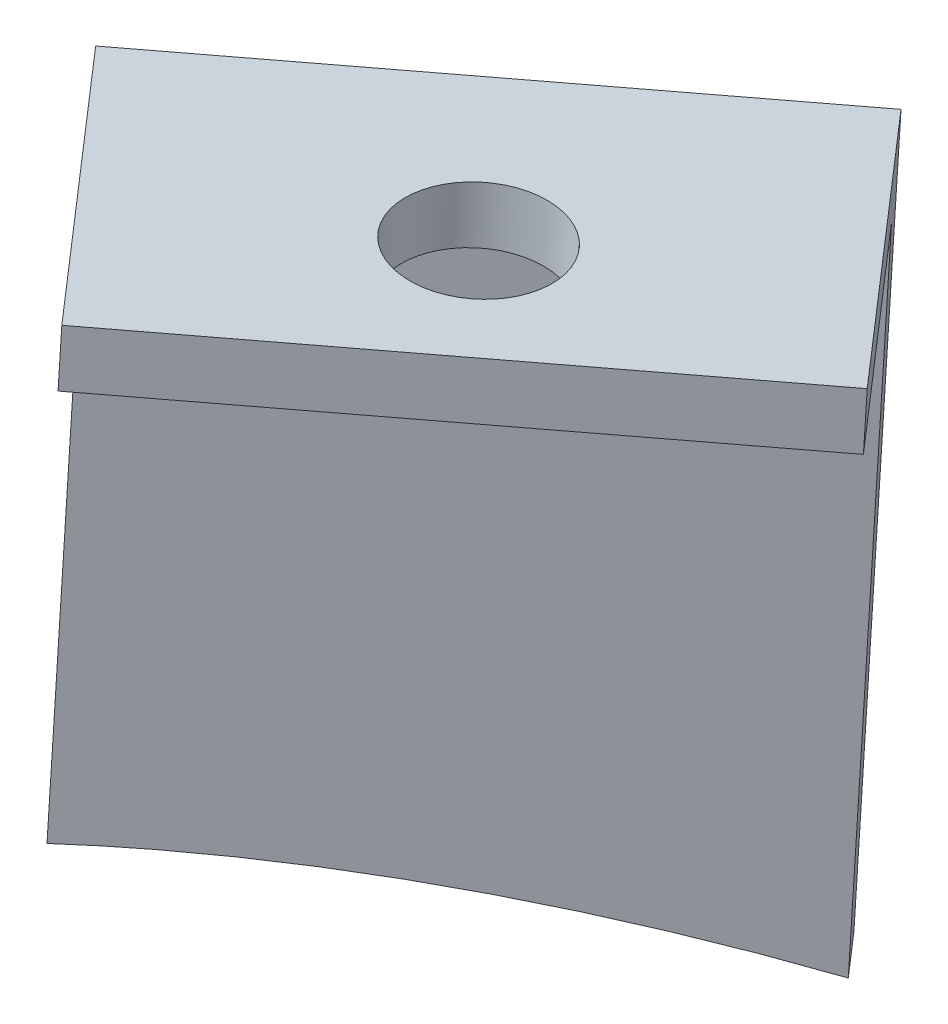
ISO-10303-21;
HEADER;
FILE_DESCRIPTION(('STEP AP214'),'2;1');
FILE_NAME('part.step','',(''),(''),'','','');
FILE_SCHEMA(('AUTOMOTIVE_DESIGN { 1 0 10303 214 1 1 1 1 }'));
ENDSEC;
DATA;
#1=APPLICATION_CONTEXT('core data for automotive mechanical design processes');
#2=APPLICATION_PROTOCOL_DEFINITION('international standard','automotive_design',2000,#1);
#3=PRODUCT_CONTEXT('',#1,'mechanical');
#4=PRODUCT('Part','Part','',(#3));
#5=PRODUCT_RELATED_PRODUCT_CATEGORY('part','',(#4));
#6=PRODUCT_DEFINITION_FORMATION('','',#4);
#7=PRODUCT_DEFINITION_CONTEXT('part definition',#1,'design');
#8=PRODUCT_DEFINITION('design','',#6,#7);
#9=PRODUCT_DEFINITION_SHAPE('','',#8);
#10=(LENGTH_UNIT() NAMED_UNIT(*) SI_UNIT(.MILLI.,.METRE.));
#11=(NAMED_UNIT(*) PLANE_ANGLE_UNIT() SI_UNIT($,.RADIAN.));
#12=(NAMED_UNIT(*) SI_UNIT($,.STERADIAN.) SOLID_ANGLE_UNIT());
#13=UNCERTAINTY_MEASURE_WITH_UNIT(LENGTH_MEASURE(1.E-05),#10,'distance_accuracy_value','');
#14=(GEOMETRIC_REPRESENTATION_CONTEXT(3) GLOBAL_UNCERTAINTY_ASSIGNED_CONTEXT((#13)) GLOBAL_UNIT_ASSIGNED_CONTEXT((#10,
#11,#12)) REPRESENTATION_CONTEXT('',''));
#15=CARTESIAN_POINT('',(0.,0.,0.));
#16=DIRECTION('',(0.,0.,1.));
#17=DIRECTION('',(1.,0.,0.));
#18=AXIS2_PLACEMENT_3D('',#15,#16,#17);
#19=CARTESIAN_POINT('',(750.093756184911,-334.295962545442,-277.678651940476));
#20=DIRECTION('',(0.656059028990509,0.,0.754709580222771));
#21=DIRECTION('',(-0.754709580222771,0.,0.656059028990509));
#22=AXIS2_PLACEMENT_3D('',#19,#20,#21);
#23=PLANE('',#22);
#24=DIRECTION('',(0.0352646019307498,0.998907741341904,-0.0306550507727672));
#25=VECTOR('',#24,1.);
#26=CARTESIAN_POINT('',(715.727479861596,-311.023047122517,-247.80450370449));
#27=LINE('',#26,#25);
#28=CARTESIAN_POINT('',(715.727479861596,-311.023047122517,-247.80450370449));
#29=VERTEX_POINT('',#28);
#30=CARTESIAN_POINT('',(716.462199431298,-290.211325857889,-248.443185682446));
#31=VERTEX_POINT('',#30);
#32=EDGE_CURVE('E148',#29,#31,#27,.T.);
#33=ORIENTED_EDGE('',*,*,#32,.F.);
#34=CARTESIAN_POINT('',(704.259954101187,-317.244408189375,-237.8359356454));
#35=CARTESIAN_POINT('',(699.15959886763,-341.313661117389,-233.402264482718));
#36=CARTESIAN_POINT('',(744.993400951354,-358.365215473456,-273.244980777793));
#37=CARTESIAN_POINT('',(750.093756184911,-334.295962545442,-277.678651940476));
#38=CARTESIAN_POINT('',(755.194111418468,-310.226709617428,-282.112323103158));
#39=CARTESIAN_POINT('',(709.360309334744,-293.175155261361,-242.269606808083));
#40=CARTESIAN_POINT('',(704.259954101187,-317.244408189375,-237.8359356454));
#41=(BOUNDED_CURVE() B_SPLINE_CURVE(3,(#34,#35,#36,#37,#38,#39,#40),.UNSPECIFIED.,.T.,
.F.) B_SPLINE_CURVE_WITH_KNOTS((4,3,4),(0.,0.5,1.),
.UNSPECIFIED.) CURVE() GEOMETRIC_REPRESENTATION_ITEM() RATIONAL_B_SPLINE_CURVE((1.,
0.333333333333333,0.333333333333333,1.,0.333333333333333,0.333333333333333,1.)) REPRESENTATION_ITEM(''));
#42=CARTESIAN_POINT('',(730.728818429882,-314.120725024025,-260.844968371392));
#43=VERTEX_POINT('',#42);
#44=EDGE_CURVE('E90',#43,#29,#41,.T.);
#45=ORIENTED_EDGE('',*,*,#44,.F.);
#46=DIRECTION('',(-0.0352646019306432,-0.998907741341911,0.0306550507726731));
#47=VECTOR('',#46,1.);
#48=CARTESIAN_POINT('',(730.728818429882,-314.120725024025,-260.844968371392));
#49=LINE('',#48,#47);
#50=CARTESIAN_POINT('',(731.539904274281,-291.14584697316,-261.55003453917));
#51=VERTEX_POINT('',#50);
#52=EDGE_CURVE('E95',#51,#43,#49,.T.);
#53=ORIENTED_EDGE('',*,*,#52,.F.);
#54=DIRECTION('',(-0.753885242149403,0.0467260557635072,0.655342442835897));
#55=VECTOR('',#54,1.);
#56=CARTESIAN_POINT('',(731.539904274281,-291.14584697316,-261.55003453917));
#57=LINE('',#56,#55);
#58=EDGE_CURVE('E140',#51,#31,#57,.T.);
#59=ORIENTED_EDGE('',*,*,#58,.T.);
#60=EDGE_LOOP('',(#33,#45,#53,#59));
#61=FACE_BOUND('',#60,.T.);
#62=ADVANCED_FACE('F37',(#61),#23,.T.);
#63=DIRECTION('',(-0.656059028990508,0.,-0.754709580222771));
#64=VECTOR('',#63,1.);
#65=SURFACE_OF_LINEAR_EXTRUSION('',#41,#64);
#66=CARTESIAN_POINT('',(702.947836043206,-317.244408189375,-239.345354805846));
#67=CARTESIAN_POINT('',(697.847480809649,-341.313661117389,-234.911683643163));
#68=CARTESIAN_POINT('',(743.681282893373,-358.365215473456,-274.754399938238));
#69=CARTESIAN_POINT('',(748.78163812693,-334.295962545442,-279.188071100921));
#70=CARTESIAN_POINT('',(753.881993360487,-310.226709617428,-283.621742263604));
#71=CARTESIAN_POINT('',(708.048191276763,-293.175155261361,-243.779025968529));
#72=CARTESIAN_POINT('',(702.947836043206,-317.244408189375,-239.345354805846));
#73=(BOUNDED_CURVE() B_SPLINE_CURVE(3,(#66,#67,#68,#69,#70,#71,#72),.UNSPECIFIED.,.T.,
.F.) B_SPLINE_CURVE_WITH_KNOTS((4,3,4),(0.,0.5,1.),
.UNSPECIFIED.) CURVE() GEOMETRIC_REPRESENTATION_ITEM() RATIONAL_B_SPLINE_CURVE((1.,
0.333333333333333,0.333333333333333,1.,0.333333333333333,0.333333333333333,1.)) REPRESENTATION_ITEM(''));
#74=CARTESIAN_POINT('',(729.416700371901,-314.120725024025,-262.354387531837));
#75=VERTEX_POINT('',#74);
#76=CARTESIAN_POINT('',(714.415361803615,-311.023047122517,-249.313922864935));
#77=VERTEX_POINT('',#76);
#78=EDGE_CURVE('E85',#75,#77,#73,.T.);
#79=ORIENTED_EDGE('',*,*,#78,.F.);
#80=DIRECTION('',(-0.656059028990508,0.,-0.754709580222771));
#81=VECTOR('',#80,1.);
#82=CARTESIAN_POINT('',(730.728818429882,-314.120725024025,-260.844968371392));
#83=LINE('',#82,#81);
#84=EDGE_CURVE('E62',#43,#75,#83,.T.);
#85=ORIENTED_EDGE('',*,*,#84,.F.);
#86=ORIENTED_EDGE('',*,*,#44,.T.);
#87=DIRECTION('',(-0.656059028990508,0.,-0.754709580222771));
#88=VECTOR('',#87,1.);
#89=CARTESIAN_POINT('',(715.727479861596,-311.023047122517,-247.80450370449));
#90=LINE('',#89,#88);
#91=EDGE_CURVE('E11',#29,#77,#90,.T.);
#92=ORIENTED_EDGE('',*,*,#91,.T.);
#93=EDGE_LOOP('',(#79,#85,#86,#92));
#94=FACE_BOUND('',#93,.T.);
#95=ADVANCED_FACE('F39',(#94),#65,.T.);
#96=CARTESIAN_POINT('',(715.727479861596,-311.023047122517,-247.80450370449));
#97=DIRECTION('',(0.753885242149425,-0.0467260557635157,-0.655342442835872));
#98=DIRECTION('',(0.656059028990509,0.,0.754709580222771));
#99=AXIS2_PLACEMENT_3D('',#96,#97,#98);
#100=PLANE('',#99);
#101=DIRECTION('',(0.0352646019307498,0.998907741341904,-0.0306550507727672));
#102=VECTOR('',#101,1.);
#103=CARTESIAN_POINT('',(714.415361803615,-311.023047122517,-249.313922864935));
#104=LINE('',#103,#102);
#105=CARTESIAN_POINT('',(715.220610577178,-288.213510375206,-250.013914944437));
#106=VERTEX_POINT('',#105);
#107=EDGE_CURVE('E99',#77,#106,#104,.T.);
#108=ORIENTED_EDGE('',*,*,#107,.F.);
#109=ORIENTED_EDGE('',*,*,#91,.F.);
#110=ORIENTED_EDGE('',*,*,#32,.T.);
#111=DIRECTION('',(-0.656059028990536,0.,-0.754709580222747));
#112=VECTOR('',#111,1.);
#113=CARTESIAN_POINT('',(723.022789721198,-290.211325857889,-240.896089880225));
#114=LINE('',#113,#112);
#115=CARTESIAN_POINT('',(723.022789721198,-290.211325857889,-240.896089880225));
#116=VERTEX_POINT('',#115);
#117=EDGE_CURVE('E53',#116,#31,#114,.T.);
#118=ORIENTED_EDGE('',*,*,#117,.F.);
#119=DIRECTION('',(-0.0352646019306998,-0.998907741341905,0.0306550507728036));
#120=VECTOR('',#119,1.);
#121=CARTESIAN_POINT('',(723.09331892506,-288.213510375205,-240.95739998177));
#122=LINE('',#121,#120);
#123=CARTESIAN_POINT('',(723.09331892506,-288.213510375205,-240.95739998177));
#124=VERTEX_POINT('',#123);
#125=EDGE_CURVE('E120',#124,#116,#122,.T.);
#126=ORIENTED_EDGE('',*,*,#125,.F.);
#127=DIRECTION('',(-0.656059028990508,0.,-0.754709580222771));
#128=VECTOR('',#127,1.);
#129=CARTESIAN_POINT('',(716.532728635159,-288.213510375206,-248.504495783991));
#130=LINE('',#129,#128);
#131=EDGE_CURVE('E46',#124,#106,#130,.T.);
#132=ORIENTED_EDGE('',*,*,#131,.T.);
#133=EDGE_LOOP('',(#108,#109,#110,#118,#126,#132));
#134=FACE_BOUND('',#133,.T.);
#135=ADVANCED_FACE('F117',(#134),#100,.F.);
#136=CARTESIAN_POINT('',(731.610433478148,-289.148031490476,-261.611344640709));
#137=DIRECTION('',(-0.0352646019307445,-0.998907741341905,0.0306550507727648));
#138=DIRECTION('',(0.999377425254299,-0.0352811832580467,0.));
#139=AXIS2_PLACEMENT_3D('',#136,#137,#138);
#140=PLANE('',#139);
#141=CARTESIAN_POINT('',(727.351876201601,-288.680770932841,-251.284372311243));
#142=DIRECTION('',(0.0352646019307445,0.998907741341905,-0.0306550507727648));
#143=DIRECTION('',(0.999377425254299,-0.0352811832580467,0.));
#144=AXIS2_PLACEMENT_3D('',#141,#142,#143);
#145=CIRCLE('',#144,2.49999999999983);
#146=CARTESIAN_POINT('',(729.850319764736,-288.768973890986,-251.284372311243));
#147=VERTEX_POINT('',#146);
#148=EDGE_CURVE('E146',#147,#147,#145,.T.);
#149=ORIENTED_EDGE('',*,*,#148,.F.);
#150=EDGE_LOOP('',(#149));
#151=FACE_BOUND('',#150,.T.);
#152=DIRECTION('',(0.753885242149426,-0.0467260557635101,-0.655342442835871));
#153=VECTOR('',#152,1.);
#154=CARTESIAN_POINT('',(730.298315420167,-289.148031490476,-263.120763801154));
#155=LINE('',#154,#153);
#156=CARTESIAN_POINT('',(730.298315420167,-289.148031490476,-263.120763801154));
#157=VERTEX_POINT('',#156);
#158=EDGE_CURVE('E86',#106,#157,#155,.T.);
#159=ORIENTED_EDGE('',*,*,#158,.F.);
#160=ORIENTED_EDGE('',*,*,#131,.F.);
#161=DIRECTION('',(-0.753885242149407,0.0467260557635072,0.655342442835892));
#162=VECTOR('',#161,1.);
#163=CARTESIAN_POINT('',(738.171023768048,-289.148031490475,-254.064248838488));
#164=LINE('',#163,#162);
#165=CARTESIAN_POINT('',(738.171023768048,-289.148031490475,-254.064248838488));
#166=VERTEX_POINT('',#165);
#167=EDGE_CURVE('E126',#166,#124,#164,.T.);
#168=ORIENTED_EDGE('',*,*,#167,.F.);
#169=DIRECTION('',(-0.656059028990508,0.,-0.754709580222771));
#170=VECTOR('',#169,1.);
#171=CARTESIAN_POINT('',(731.610433478148,-289.148031490476,-261.611344640709));
#172=LINE('',#171,#170);
#173=EDGE_CURVE('E97',#166,#157,#172,.T.);
#174=ORIENTED_EDGE('',*,*,#173,.T.);
#175=EDGE_LOOP('',(#159,#160,#168,#174));
#176=FACE_BOUND('',#175,.T.);
#177=ADVANCED_FACE('F123',(#151,#176),#140,.F.);
#178=CARTESIAN_POINT('',(730.728818429882,-314.120725024025,-260.844968371392));
#179=DIRECTION('',(-0.75388524214943,0.0467260557633735,0.655342442835876));
#180=DIRECTION('',(-0.656059028990508,0.,-0.754709580222771));
#181=AXIS2_PLACEMENT_3D('',#178,#179,#180);
#182=PLANE('',#181);
#183=DIRECTION('',(-0.0352646019306432,-0.998907741341911,0.0306550507726731));
#184=VECTOR('',#183,1.);
#185=CARTESIAN_POINT('',(729.416700371901,-314.120725024025,-262.354387531837));
#186=LINE('',#185,#184);
#187=EDGE_CURVE('E82',#157,#75,#186,.T.);
#188=ORIENTED_EDGE('',*,*,#187,.F.);
#189=ORIENTED_EDGE('',*,*,#173,.F.);
#190=DIRECTION('',(0.0352646019306988,0.998907741341905,-0.0306550507728027));
#191=VECTOR('',#190,1.);
#192=CARTESIAN_POINT('',(738.100494564186,-291.145846973159,-254.002938736943));
#193=LINE('',#192,#191);
#194=CARTESIAN_POINT('',(738.100494564186,-291.145846973159,-254.002938736943));
#195=VERTEX_POINT('',#194);
#196=EDGE_CURVE('E138',#195,#166,#193,.T.);
#197=ORIENTED_EDGE('',*,*,#196,.F.);
#198=DIRECTION('',(-0.656059028990536,0.,-0.754709580222747));
#199=VECTOR('',#198,1.);
#200=CARTESIAN_POINT('',(738.100494564186,-291.145846973159,-254.002938736943));
#201=LINE('',#200,#199);
#202=EDGE_CURVE('E102',#195,#51,#201,.T.);
#203=ORIENTED_EDGE('',*,*,#202,.T.);
#204=ORIENTED_EDGE('',*,*,#52,.T.);
#205=ORIENTED_EDGE('',*,*,#84,.T.);
#206=EDGE_LOOP('',(#188,#189,#197,#203,#204,#205));
#207=FACE_BOUND('',#206,.T.);
#208=ADVANCED_FACE('F92',(#207),#182,.F.);
#209=CARTESIAN_POINT('',(748.78163812693,-334.295962545442,-279.188071100921));
#210=DIRECTION('',(0.656059028990509,0.,0.754709580222771));
#211=DIRECTION('',(-0.754709580222771,0.,0.656059028990509));
#212=AXIS2_PLACEMENT_3D('',#209,#210,#211);
#213=PLANE('',#212);
#214=ORIENTED_EDGE('',*,*,#78,.T.);
#215=ORIENTED_EDGE('',*,*,#107,.T.);
#216=ORIENTED_EDGE('',*,*,#158,.T.);
#217=ORIENTED_EDGE('',*,*,#187,.T.);
#218=EDGE_LOOP('',(#214,#215,#216,#217));
#219=FACE_BOUND('',#218,.T.);
#220=ADVANCED_FACE('F83',(#219),#213,.F.);
#221=CARTESIAN_POINT('',(738.100494564186,-291.145846973159,-254.002938736943));
#222=DIRECTION('',(0.0352646019307039,0.998907741341905,-0.0306550507728071));
#223=DIRECTION('',(-0.999377425254301,0.0352811832580061,0.));
#224=AXIS2_PLACEMENT_3D('',#221,#222,#223);
#225=PLANE('',#224);
#226=CARTESIAN_POINT('',(727.28134699774,-290.678586415524,-251.223062209697));
#227=DIRECTION('',(0.0352646019307039,0.998907741341905,-0.0306550507728071));
#228=DIRECTION('',(0.999377425254301,-0.0352811832580061,0.));
#229=AXIS2_PLACEMENT_3D('',#226,#227,#228);
#230=CIRCLE('',#229,2.49999999999983);
#231=CARTESIAN_POINT('',(729.779790560875,-290.766789373669,-251.223062209697));
#232=VERTEX_POINT('',#231);
#233=EDGE_CURVE('E162',#232,#232,#230,.T.);
#234=ORIENTED_EDGE('',*,*,#233,.T.);
#235=EDGE_LOOP('',(#234));
#236=FACE_BOUND('',#235,.T.);
#237=ORIENTED_EDGE('',*,*,#58,.F.);
#238=ORIENTED_EDGE('',*,*,#202,.F.);
#239=DIRECTION('',(-0.753885242149403,0.0467260557635072,0.655342442835897));
#240=VECTOR('',#239,1.);
#241=CARTESIAN_POINT('',(738.100494564186,-291.145846973159,-254.002938736943));
#242=LINE('',#241,#240);
#243=EDGE_CURVE('E145',#195,#116,#242,.T.);
#244=ORIENTED_EDGE('',*,*,#243,.T.);
#245=ORIENTED_EDGE('',*,*,#117,.T.);
#246=EDGE_LOOP('',(#237,#238,#244,#245));
#247=FACE_BOUND('',#246,.T.);
#248=ADVANCED_FACE('F141',(#236,#247),#225,.F.);
#249=CARTESIAN_POINT('',(191.922880158915,1.65650143864172E-13,220.782017957678));
#250=DIRECTION('',(-0.656059028990536,0.,-0.754709580222747));
#251=DIRECTION('',(0.,1.,0.));
#252=AXIS2_PLACEMENT_3D('',#249,#250,#251);
#253=PLANE('',#252);
#254=ORIENTED_EDGE('',*,*,#243,.F.);
#255=ORIENTED_EDGE('',*,*,#196,.T.);
#256=ORIENTED_EDGE('',*,*,#167,.T.);
#257=ORIENTED_EDGE('',*,*,#125,.T.);
#258=EDGE_LOOP('',(#254,#255,#256,#257));
#259=FACE_BOUND('',#258,.T.);
#260=ADVANCED_FACE('F170',(#259),#253,.F.);
#261=CARTESIAN_POINT('',(727.633993017047,-280.689509002105,-251.529612717425));
#262=DIRECTION('',(-0.0352646019307039,-0.998907741341905,0.0306550507728071));
#263=DIRECTION('',(0.999377425254301,-0.0352811832580061,0.));
#264=AXIS2_PLACEMENT_3D('',#261,#262,#263);
#265=CYLINDRICAL_SURFACE('',#264,2.49999999999983);
#266=ORIENTED_EDGE('',*,*,#233,.F.);
#267=EDGE_LOOP('',(#266));
#268=FACE_BOUND('',#267,.T.);
#269=ORIENTED_EDGE('',*,*,#148,.T.);
#270=EDGE_LOOP('',(#269));
#271=FACE_BOUND('',#270,.T.);
#272=ADVANCED_FACE('F167',(#268,#271),#265,.F.);
#273=CLOSED_SHELL('',(#62,#95,#135,#177,#208,#220,#248,#260,#272));
#274=MANIFOLD_SOLID_BREP('B2',#273);
#275=ADVANCED_BREP_SHAPE_REPRESENTATION('',(#18,#274),#14);
#276=SHAPE_DEFINITION_REPRESENTATION(#9,#275);
ENDSEC;
END-ISO-10303-21;
